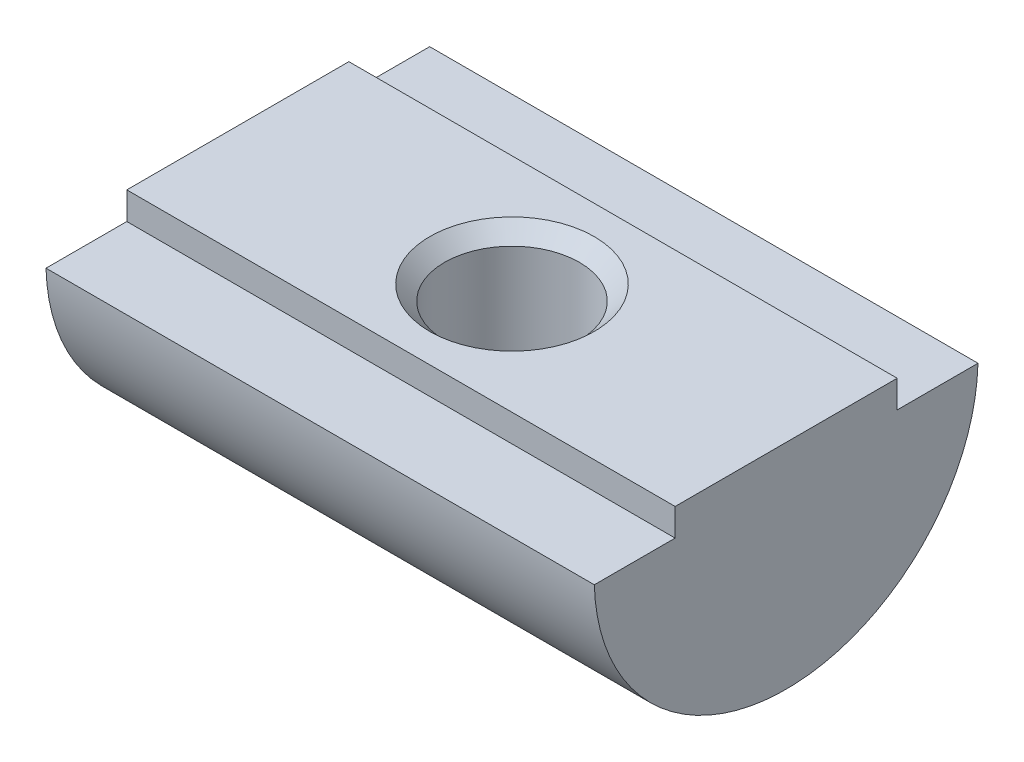
ISO-10303-21;
HEADER;
FILE_DESCRIPTION(('STEP AP214'),'2;1');
FILE_NAME('part.step','',(''),(''),'','','');
FILE_SCHEMA(('AUTOMOTIVE_DESIGN { 1 0 10303 214 1 1 1 1 }'));
ENDSEC;
DATA;
#1=APPLICATION_CONTEXT('core data for automotive mechanical design processes');
#2=APPLICATION_PROTOCOL_DEFINITION('international standard','automotive_design',2000,#1);
#3=PRODUCT_CONTEXT('',#1,'mechanical');
#4=PRODUCT('Part','Part','',(#3));
#5=PRODUCT_RELATED_PRODUCT_CATEGORY('part','',(#4));
#6=PRODUCT_DEFINITION_FORMATION('','',#4);
#7=PRODUCT_DEFINITION_CONTEXT('part definition',#1,'design');
#8=PRODUCT_DEFINITION('design','',#6,#7);
#9=PRODUCT_DEFINITION_SHAPE('','',#8);
#10=(LENGTH_UNIT() NAMED_UNIT(*) SI_UNIT(.MILLI.,.METRE.));
#11=(NAMED_UNIT(*) PLANE_ANGLE_UNIT() SI_UNIT($,.RADIAN.));
#12=(NAMED_UNIT(*) SI_UNIT($,.STERADIAN.) SOLID_ANGLE_UNIT());
#13=UNCERTAINTY_MEASURE_WITH_UNIT(LENGTH_MEASURE(1.E-05),#10,'distance_accuracy_value','');
#14=(GEOMETRIC_REPRESENTATION_CONTEXT(3) GLOBAL_UNCERTAINTY_ASSIGNED_CONTEXT((#13)) GLOBAL_UNIT_ASSIGNED_CONTEXT((#10,
#11,#12)) REPRESENTATION_CONTEXT('',''));
#15=CARTESIAN_POINT('',(0.,0.,0.));
#16=DIRECTION('',(0.,0.,1.));
#17=DIRECTION('',(1.,0.,0.));
#18=AXIS2_PLACEMENT_3D('',#15,#16,#17);
#19=CARTESIAN_POINT('',(0.,0.999999999976353,0.));
#20=DIRECTION('',(0.,1.,0.));
#21=DIRECTION('',(0.,0.,1.));
#22=AXIS2_PLACEMENT_3D('',#19,#20,#21);
#23=CONICAL_SURFACE('',#22,2.9999999999859,0.785398163397448);
#24=CARTESIAN_POINT('',(0.,0.999999999976353,0.));
#25=DIRECTION('',(0.,1.,0.));
#26=DIRECTION('',(0.,0.,1.));
#27=AXIS2_PLACEMENT_3D('',#24,#25,#26);
#28=CIRCLE('',#27,2.9999999999859);
#29=CARTESIAN_POINT('',(0.,0.999999999976353,2.9999999999859));
#30=VERTEX_POINT('',#29);
#31=EDGE_CURVE('E20',#30,#30,#28,.T.);
#32=ORIENTED_EDGE('',*,*,#31,.T.);
#33=EDGE_LOOP('',(#32));
#34=FACE_BOUND('',#33,.T.);
#35=CARTESIAN_POINT('',(0.,0.458499999999993,0.));
#36=DIRECTION('',(0.,-1.,0.));
#37=DIRECTION('',(0.,0.,-1.));
#38=AXIS2_PLACEMENT_3D('',#35,#36,#37);
#39=CIRCLE('',#38,2.4585);
#40=CARTESIAN_POINT('',(0.,0.458499999999993,-2.4585));
#41=VERTEX_POINT('',#40);
#42=EDGE_CURVE('E125',#41,#41,#39,.T.);
#43=ORIENTED_EDGE('',*,*,#42,.T.);
#44=EDGE_LOOP('',(#43));
#45=FACE_BOUND('',#44,.T.);
#46=ADVANCED_FACE('F17',(#34,#45),#23,.F.);
#47=CARTESIAN_POINT('',(10.,0.,-4.05));
#48=DIRECTION('',(0.,0.,1.));
#49=DIRECTION('',(1.,0.,0.));
#50=AXIS2_PLACEMENT_3D('',#47,#48,#49);
#51=PLANE('',#50);
#52=DIRECTION('',(1.,0.,0.));
#53=VECTOR('',#52,1.);
#54=CARTESIAN_POINT('',(10.,1.,-4.05));
#55=LINE('',#54,#53);
#56=CARTESIAN_POINT('',(-10.,1.,-4.05));
#57=VERTEX_POINT('',#56);
#58=CARTESIAN_POINT('',(10.,1.,-4.05));
#59=VERTEX_POINT('',#58);
#60=EDGE_CURVE('E83',#57,#59,#55,.T.);
#61=ORIENTED_EDGE('',*,*,#60,.T.);
#62=DIRECTION('',(0.,1.,0.));
#63=VECTOR('',#62,1.);
#64=CARTESIAN_POINT('',(10.,0.,-4.05));
#65=LINE('',#64,#63);
#66=CARTESIAN_POINT('',(10.,0.,-4.05));
#67=VERTEX_POINT('',#66);
#68=EDGE_CURVE('E77',#67,#59,#65,.T.);
#69=ORIENTED_EDGE('',*,*,#68,.F.);
#70=DIRECTION('',(1.,0.,0.));
#71=VECTOR('',#70,1.);
#72=CARTESIAN_POINT('',(10.,0.,-4.05));
#73=LINE('',#72,#71);
#74=CARTESIAN_POINT('',(-10.,0.,-4.05));
#75=VERTEX_POINT('',#74);
#76=EDGE_CURVE('E80',#67,#75,#73,.F.);
#77=ORIENTED_EDGE('',*,*,#76,.T.);
#78=DIRECTION('',(0.,1.,0.));
#79=VECTOR('',#78,1.);
#80=CARTESIAN_POINT('',(-10.,0.200000000000001,-4.05));
#81=LINE('',#80,#79);
#82=EDGE_CURVE('E128',#75,#57,#81,.T.);
#83=ORIENTED_EDGE('',*,*,#82,.T.);
#84=EDGE_LOOP('',(#61,#69,#77,#83));
#85=FACE_BOUND('',#84,.T.);
#86=ADVANCED_FACE('F79',(#85),#51,.F.);
#87=CARTESIAN_POINT('',(10.,1.,-4.05));
#88=DIRECTION('',(0.,-1.,0.));
#89=DIRECTION('',(0.,0.,-1.));
#90=AXIS2_PLACEMENT_3D('',#87,#88,#89);
#91=PLANE('',#90);
#92=ORIENTED_EDGE('',*,*,#31,.F.);
#93=EDGE_LOOP('',(#92));
#94=FACE_BOUND('',#93,.T.);
#95=DIRECTION('',(-1.,0.,0.));
#96=VECTOR('',#95,1.);
#97=CARTESIAN_POINT('',(10.,1.,4.05));
#98=LINE('',#97,#96);
#99=CARTESIAN_POINT('',(-10.,1.,4.05));
#100=VERTEX_POINT('',#99);
#101=CARTESIAN_POINT('',(10.,1.,4.05));
#102=VERTEX_POINT('',#101);
#103=EDGE_CURVE('E129',#100,#102,#98,.F.);
#104=ORIENTED_EDGE('',*,*,#103,.T.);
#105=DIRECTION('',(0.,0.,-1.));
#106=VECTOR('',#105,1.);
#107=CARTESIAN_POINT('',(10.,1.,0.));
#108=LINE('',#107,#106);
#109=EDGE_CURVE('E100',#59,#102,#108,.F.);
#110=ORIENTED_EDGE('',*,*,#109,.F.);
#111=ORIENTED_EDGE('',*,*,#60,.F.);
#112=DIRECTION('',(0.,0.,-1.));
#113=VECTOR('',#112,1.);
#114=CARTESIAN_POINT('',(-10.,1.,0.));
#115=LINE('',#114,#113);
#116=EDGE_CURVE('E133',#57,#100,#115,.F.);
#117=ORIENTED_EDGE('',*,*,#116,.T.);
#118=EDGE_LOOP('',(#104,#110,#111,#117));
#119=FACE_BOUND('',#118,.T.);
#120=ADVANCED_FACE('F196',(#94,#119),#91,.F.);
#121=CARTESIAN_POINT('',(10.,1.,4.05));
#122=DIRECTION('',(0.,0.,-1.));
#123=DIRECTION('',(-1.,0.,0.));
#124=AXIS2_PLACEMENT_3D('',#121,#122,#123);
#125=PLANE('',#124);
#126=DIRECTION('',(1.,0.,0.));
#127=VECTOR('',#126,1.);
#128=CARTESIAN_POINT('',(10.,0.,4.05));
#129=LINE('',#128,#127);
#130=CARTESIAN_POINT('',(-10.,0.,4.05));
#131=VERTEX_POINT('',#130);
#132=CARTESIAN_POINT('',(10.,0.,4.05));
#133=VERTEX_POINT('',#132);
#134=EDGE_CURVE('E56',#131,#133,#129,.T.);
#135=ORIENTED_EDGE('',*,*,#134,.T.);
#136=DIRECTION('',(0.,1.,0.));
#137=VECTOR('',#136,1.);
#138=CARTESIAN_POINT('',(10.,0.200000000000001,4.05));
#139=LINE('',#138,#137);
#140=EDGE_CURVE('E102',#102,#133,#139,.F.);
#141=ORIENTED_EDGE('',*,*,#140,.F.);
#142=ORIENTED_EDGE('',*,*,#103,.F.);
#143=DIRECTION('',(0.,1.,0.));
#144=VECTOR('',#143,1.);
#145=CARTESIAN_POINT('',(-10.,0.200000000000001,4.05));
#146=LINE('',#145,#144);
#147=EDGE_CURVE('E94',#100,#131,#146,.F.);
#148=ORIENTED_EDGE('',*,*,#147,.T.);
#149=EDGE_LOOP('',(#135,#141,#142,#148));
#150=FACE_BOUND('',#149,.T.);
#151=ADVANCED_FACE('F187',(#150),#125,.F.);
#152=CARTESIAN_POINT('',(0.,1.,0.));
#153=DIRECTION('',(0.,-1.,0.));
#154=DIRECTION('',(0.,0.,-1.));
#155=AXIS2_PLACEMENT_3D('',#152,#153,#154);
#156=CYLINDRICAL_SURFACE('',#155,2.4585);
#157=CARTESIAN_POINT('',(0.,-6.25850000005812,0.));
#158=DIRECTION('',(0.,-1.,0.));
#159=DIRECTION('',(0.,0.,-1.));
#160=AXIS2_PLACEMENT_3D('',#157,#158,#159);
#161=CIRCLE('',#160,2.45849999993197);
#162=CARTESIAN_POINT('',(0.,-6.25850000005812,-2.45849999993197));
#163=VERTEX_POINT('',#162);
#164=EDGE_CURVE('E122',#163,#163,#161,.T.);
#165=ORIENTED_EDGE('',*,*,#164,.T.);
#166=EDGE_LOOP('',(#165));
#167=FACE_BOUND('',#166,.T.);
#168=ORIENTED_EDGE('',*,*,#42,.F.);
#169=EDGE_LOOP('',(#168));
#170=FACE_BOUND('',#169,.T.);
#171=ADVANCED_FACE('F182',(#167,#170),#156,.F.);
#172=CARTESIAN_POINT('',(-10.,0.200000000000001,0.));
#173=DIRECTION('',(1.,0.,0.));
#174=DIRECTION('',(0.,0.,-1.));
#175=AXIS2_PLACEMENT_3D('',#172,#173,#174);
#176=PLANE('',#175);
#177=DIRECTION('',(0.,0.,-1.));
#178=VECTOR('',#177,1.);
#179=CARTESIAN_POINT('',(-10.,0.,4.05));
#180=LINE('',#179,#178);
#181=CARTESIAN_POINT('',(-10.,0.,6.99714227381436));
#182=VERTEX_POINT('',#181);
#183=EDGE_CURVE('E116',#182,#131,#180,.T.);
#184=ORIENTED_EDGE('',*,*,#183,.T.);
#185=ORIENTED_EDGE('',*,*,#147,.F.);
#186=ORIENTED_EDGE('',*,*,#116,.F.);
#187=ORIENTED_EDGE('',*,*,#82,.F.);
#188=DIRECTION('',(0.,0.,-1.));
#189=VECTOR('',#188,1.);
#190=CARTESIAN_POINT('',(-10.,0.,-6.99714227381436));
#191=LINE('',#190,#189);
#192=CARTESIAN_POINT('',(-10.,0.,-6.99714227381436));
#193=VERTEX_POINT('',#192);
#194=EDGE_CURVE('E93',#75,#193,#191,.T.);
#195=ORIENTED_EDGE('',*,*,#194,.T.);
#196=CARTESIAN_POINT('',(-10.,0.200000000000001,0.));
#197=DIRECTION('',(-1.,0.,0.));
#198=DIRECTION('',(0.,0.,1.));
#199=AXIS2_PLACEMENT_3D('',#196,#197,#198);
#200=CIRCLE('',#199,7.);
#201=EDGE_CURVE('E47',#182,#193,#200,.F.);
#202=ORIENTED_EDGE('',*,*,#201,.F.);
#203=EDGE_LOOP('',(#184,#185,#186,#187,#195,#202));
#204=FACE_BOUND('',#203,.T.);
#205=ADVANCED_FACE('F186',(#204),#176,.F.);
#206=CARTESIAN_POINT('',(10.,0.,-6.99714227381436));
#207=DIRECTION('',(0.,-1.,0.));
#208=DIRECTION('',(0.,0.,-1.));
#209=AXIS2_PLACEMENT_3D('',#206,#207,#208);
#210=PLANE('',#209);
#211=ORIENTED_EDGE('',*,*,#76,.F.);
#212=DIRECTION('',(0.,0.,-1.));
#213=VECTOR('',#212,1.);
#214=CARTESIAN_POINT('',(10.,0.,0.));
#215=LINE('',#214,#213);
#216=CARTESIAN_POINT('',(10.,0.,-6.99714227381436));
#217=VERTEX_POINT('',#216);
#218=EDGE_CURVE('E92',#217,#67,#215,.F.);
#219=ORIENTED_EDGE('',*,*,#218,.F.);
#220=DIRECTION('',(-1.,0.,0.));
#221=VECTOR('',#220,1.);
#222=CARTESIAN_POINT('',(10.,0.,-6.99714227381436));
#223=LINE('',#222,#221);
#224=EDGE_CURVE('E111',#193,#217,#223,.F.);
#225=ORIENTED_EDGE('',*,*,#224,.F.);
#226=ORIENTED_EDGE('',*,*,#194,.F.);
#227=EDGE_LOOP('',(#211,#219,#225,#226));
#228=FACE_BOUND('',#227,.T.);
#229=ADVANCED_FACE('F90',(#228),#210,.F.);
#230=CARTESIAN_POINT('',(10.,0.200000000000001,0.));
#231=DIRECTION('',(1.,0.,0.));
#232=DIRECTION('',(0.,0.,-1.));
#233=AXIS2_PLACEMENT_3D('',#230,#231,#232);
#234=PLANE('',#233);
#235=ORIENTED_EDGE('',*,*,#140,.T.);
#236=DIRECTION('',(0.,0.,-1.));
#237=VECTOR('',#236,1.);
#238=CARTESIAN_POINT('',(10.,0.,4.05));
#239=LINE('',#238,#237);
#240=CARTESIAN_POINT('',(10.,0.,6.99714227381436));
#241=VERTEX_POINT('',#240);
#242=EDGE_CURVE('E35',#133,#241,#239,.F.);
#243=ORIENTED_EDGE('',*,*,#242,.T.);
#244=CARTESIAN_POINT('',(10.,0.200000000000001,0.));
#245=DIRECTION('',(-1.,0.,0.));
#246=DIRECTION('',(0.,0.,1.));
#247=AXIS2_PLACEMENT_3D('',#244,#245,#246);
#248=CIRCLE('',#247,7.);
#249=EDGE_CURVE('E98',#217,#241,#248,.T.);
#250=ORIENTED_EDGE('',*,*,#249,.F.);
#251=ORIENTED_EDGE('',*,*,#218,.T.);
#252=ORIENTED_EDGE('',*,*,#68,.T.);
#253=ORIENTED_EDGE('',*,*,#109,.T.);
#254=EDGE_LOOP('',(#235,#243,#250,#251,#252,#253));
#255=FACE_BOUND('',#254,.T.);
#256=ADVANCED_FACE('F96',(#255),#234,.T.);
#257=CARTESIAN_POINT('',(10.,0.,4.05));
#258=DIRECTION('',(0.,-1.,0.));
#259=DIRECTION('',(0.,0.,-1.));
#260=AXIS2_PLACEMENT_3D('',#257,#258,#259);
#261=PLANE('',#260);
#262=DIRECTION('',(-1.,0.,0.));
#263=VECTOR('',#262,1.);
#264=CARTESIAN_POINT('',(10.,0.,6.99714227381436));
#265=LINE('',#264,#263);
#266=EDGE_CURVE('E26',#241,#182,#265,.T.);
#267=ORIENTED_EDGE('',*,*,#266,.F.);
#268=ORIENTED_EDGE('',*,*,#242,.F.);
#269=ORIENTED_EDGE('',*,*,#134,.F.);
#270=ORIENTED_EDGE('',*,*,#183,.F.);
#271=EDGE_LOOP('',(#267,#268,#269,#270));
#272=FACE_BOUND('',#271,.T.);
#273=ADVANCED_FACE('F175',(#272),#261,.F.);
#274=CARTESIAN_POINT('',(0.,-6.80332464787625,0.));
#275=DIRECTION('',(0.,-1.,0.));
#276=DIRECTION('',(0.,0.,-1.));
#277=AXIS2_PLACEMENT_3D('',#274,#275,#276);
#278=CONICAL_SURFACE('',#277,3.00332464775011,0.785398163397448);
#279=CARTESIAN_POINT('',(0.,-6.3276925690884,-2.52769256898105));
#280=CARTESIAN_POINT('',(-0.183875042928642,-6.32770082941167,-2.52768699805773));
#281=CARTESIAN_POINT('',(-0.367845647121173,-6.33336261232259,-2.51319782214442));
#282=CARTESIAN_POINT('',(-0.730739180788536,-6.35528108112437,-2.45544446498763));
#283=CARTESIAN_POINT('',(-0.909655795355433,-6.37155045882868,-2.41214581240299));
#284=CARTESIAN_POINT('',(-1.25732267176799,-6.41256070185786,-2.29733535766257));
#285=CARTESIAN_POINT('',(-1.4260658418828,-6.43730739808181,-2.22580413131193));
#286=CARTESIAN_POINT('',(-1.74809299576108,-6.49208926995522,-2.05522197715682));
#287=CARTESIAN_POINT('',(-1.90138665244656,-6.52212110382827,-1.95618841625745));
#288=CARTESIAN_POINT('',(-2.16025875110304,-6.57778280881526,-1.75232461794637));
#289=CARTESIAN_POINT('',(-2.26941502567967,-6.60319697205487,-1.65197029317303));
#290=CARTESIAN_POINT('',(-2.46978318301668,-6.65237136029756,-1.43436307112869));
#291=CARTESIAN_POINT('',(-2.56101836143281,-6.67613370617334,-1.31713245971191));
#292=CARTESIAN_POINT('',(-2.70777567215198,-6.71570078671798,-1.08822539025947));
#293=CARTESIAN_POINT('',(-2.76671236789136,-6.73217169305242,-0.978859039299437));
#294=CARTESIAN_POINT('',(-2.86617928907274,-6.76048893076501,-0.75145331286502));
#295=CARTESIAN_POINT('',(-2.90672036899665,-6.77233798872124,-0.633419099832457));
#296=CARTESIAN_POINT('',(-2.96708763368817,-6.79013209326777,-0.390997501386833));
#297=CARTESIAN_POINT('',(-2.98680296119227,-6.79604553585583,-0.266579776748751));
#298=CARTESIAN_POINT('',(-3.00367769612878,-6.80110051980282,-0.0160901967009481));
#299=CARTESIAN_POINT('',(-3.00084442771188,-6.80024426007176,0.109981108316434));
#300=CARTESIAN_POINT('',(-2.97414377006762,-6.79226490426933,0.348064850664954));
#301=CARTESIAN_POINT('',(-2.95219646000242,-6.78571396885392,0.460319777481792));
#302=CARTESIAN_POINT('',(-2.89116052363825,-6.76779849771431,0.679631910070351));
#303=CARTESIAN_POINT('',(-2.85206920509298,-6.75643320596685,0.786688296544057));
#304=CARTESIAN_POINT('',(-2.75678121574292,-6.72939505416925,0.997630361632043));
#305=CARTESIAN_POINT('',(-2.69994906393542,-6.71356471945751,1.10120618768842));
#306=CARTESIAN_POINT('',(-2.57225360268992,-6.67919079072546,1.29877203168461));
#307=CARTESIAN_POINT('',(-2.50138424621341,-6.66064602826811,1.39275789186571));
#308=CARTESIAN_POINT('',(-2.33577796864177,-6.61917870619764,1.58425448136722));
#309=CARTESIAN_POINT('',(-2.23903946735093,-6.59602709563269,1.67998136910698));
#310=CARTESIAN_POINT('',(-2.03288673842924,-6.54989751898719,1.85667331482522));
#311=CARTESIAN_POINT('',(-1.92346400203276,-6.52691968061166,1.93762836883827));
#312=CARTESIAN_POINT('',(-1.67366417196022,-6.4789014551803,2.09773530517361));
#313=CARTESIAN_POINT('',(-1.5312777647561,-6.45424670332447,2.17387794563575));
#314=CARTESIAN_POINT('',(-1.23611607981285,-6.41016014987195,2.30446000967173));
#315=CARTESIAN_POINT('',(-1.08333578199974,-6.39073089486543,2.35888885748255));
#316=CARTESIAN_POINT('',(-0.75370459445273,-6.35734125429752,2.45029324805457));
#317=CARTESIAN_POINT('',(-0.576050477542983,-6.34421332208957,2.48470307337978));
#318=CARTESIAN_POINT('',(-0.217117336767713,-6.32852372866342,2.52564082718632));
#319=CARTESIAN_POINT('',(-0.0358382726575947,-6.32596218482004,2.53216844594321));
#320=CARTESIAN_POINT('',(0.328606367240124,-6.33178872952853,2.51710291164531));
#321=CARTESIAN_POINT('',(0.511748383601869,-6.3403718129804,2.49500899002381));
#322=CARTESIAN_POINT('',(0.8715571659619,-6.36768874428197,2.42218008919936));
#323=CARTESIAN_POINT('',(1.04822057394879,-6.38642777896517,2.37143047444539));
#324=CARTESIAN_POINT('',(1.39013650249342,-6.43164102894239,2.24188253988551));
#325=CARTESIAN_POINT('',(1.55537581598801,-6.45812401784144,2.16305238367036));
#326=CARTESIAN_POINT('',(1.86897340254195,-6.5154070026506,1.97804265315564));
#327=CARTESIAN_POINT('',(2.01734380829866,-6.54620385983624,1.87188291692858));
#328=CARTESIAN_POINT('',(2.26228381781266,-6.60142649202982,1.65832852774478));
#329=CARTESIAN_POINT('',(2.36318577834834,-6.62583038597398,1.55588648181704));
#330=CARTESIAN_POINT('',(2.54693398452102,-6.67234666114212,1.33547058986711));
#331=CARTESIAN_POINT('',(2.62980459149486,-6.69446211270898,1.21751804962807));
#332=CARTESIAN_POINT('',(2.76202583548335,-6.73080461705758,0.987565534620174));
#333=CARTESIAN_POINT('',(2.81459463291753,-6.74572479772118,0.877530995232338));
#334=CARTESIAN_POINT('',(2.90127995410521,-6.77070657433397,0.649864798572439));
#335=CARTESIAN_POINT('',(2.93540697168623,-6.78077093301546,0.532237504515312));
#336=CARTESIAN_POINT('',(2.98320169112746,-6.79494779763766,0.291950628394113));
#337=CARTESIAN_POINT('',(2.99677847961462,-6.7990338531671,0.169271136932888));
#338=CARTESIAN_POINT('',(3.00219923946648,-6.80065948409175,-0.0766079474771212));
#339=CARTESIAN_POINT('',(2.99404671811888,-6.79820011597178,-0.199807453286639));
#340=CARTESIAN_POINT('',(2.95803101832586,-6.78747024011741,-0.433518163940912));
#341=CARTESIAN_POINT('',(2.93168446285996,-6.77964717753286,-0.544290062943397));
#342=CARTESIAN_POINT('',(2.86242243868644,-6.7594592911821,-0.760053013065582));
#343=CARTESIAN_POINT('',(2.81950373531962,-6.74709358077539,-0.865042931046666));
#344=CARTESIAN_POINT('',(2.71611001424912,-6.71807273966963,-1.07330733012901));
#345=CARTESIAN_POINT('',(2.65473859318396,-6.70120531857211,-1.17610376299683));
#346=CARTESIAN_POINT('',(2.51817767853513,-6.66503916844399,-1.37154470999261));
#347=CARTESIAN_POINT('',(2.44298200633129,-6.64573935349536,-1.46418465510096));
#348=CARTESIAN_POINT('',(2.26763253460217,-6.60282879251741,-1.65299518040059));
#349=CARTESIAN_POINT('',(2.16540777818952,-6.57903432635423,-1.74719816742128));
#350=CARTESIAN_POINT('',(1.94843420393087,-6.53210902889361,-1.92009037657919));
#351=CARTESIAN_POINT('',(1.8336751124285,-6.50897876190917,-1.99876672194215));
#352=CARTESIAN_POINT('',(1.57293614832251,-6.46130903658274,-2.15280934792353));
#353=CARTESIAN_POINT('',(1.42503715029546,-6.43725311949436,-2.22508669166626));
#354=CARTESIAN_POINT('',(1.11945208333268,-6.39514704155183,-2.34695727077979));
#355=CARTESIAN_POINT('',(0.961769179328522,-6.37709495045372,-2.39655779872451));
#356=CARTESIAN_POINT('',(0.670248354089416,-6.35150326465236,-2.46553784963167));
#357=CARTESIAN_POINT('',(0.53743689785811,-6.34263217519255,-2.48882467137287));
#358=CARTESIAN_POINT('',(0.269767420908022,-6.33072384188021,-2.51990395582233));
#359=CARTESIAN_POINT('',(0.134909431637078,-6.32768650847517,-2.52769665637695));
#360=CARTESIAN_POINT('',(0.,-6.3276925690884,-2.52769256898105));
#361=B_SPLINE_CURVE_WITH_KNOTS('',3,(#279,#280,#281,#282,#283,#284,#285,#286,#287,#288,#289,
#290,#291,#292,#293,#294,#295,#296,#297,#298,#299,#300,#301,#302,#303,#304,#305,#306,#307,#308,
#309,#310,#311,#312,#313,#314,#315,#316,#317,#318,#319,#320,#321,#322,#323,#324,#325,#326,#327,
#328,#329,#330,#331,#332,#333,#334,#335,#336,#337,#338,#339,#340,#341,#342,#343,#344,#345,#346,
#347,#348,#349,#350,#351,#352,#353,#354,#355,#356,#357,#358,#359,#360),.UNSPECIFIED.,.T.,.F.,(4,
2,2,2,2,2,2,2,2,2,2,2,2,2,2,2,2,2,2,2,2,2,2,2,2,2,2,2,2,2,2,2,2,2,2,2,2,2,2,2,4),(0.,
0.551143052905681,1.10294675258009,1.65513076043844,2.20696687032361,2.65653004917855,
3.10550491571873,3.4799272205713,3.85412830629619,4.23031141047219,4.60637232924605,
4.94851691886872,5.29071525715341,5.64694062705282,6.00331978910759,6.41593202494503,
6.82882266638708,7.31685292661339,7.80512059398366,8.34688623152393,8.88865788715415,
9.44003773975563,9.99169945804784,10.5439886258286,11.0958780212576,11.5317306500899,
11.9669907107145,12.3340189905631,12.7008382017632,13.0692755112492,13.4376533555523,
13.7785354638136,14.1194841413144,14.4808219549244,14.8423216594571,15.2638421609838,
15.685710788195,16.1827657849671,16.6796608225788,17.0840416251933,17.4884162202115),.UNSPECIFIED.);
#362=CARTESIAN_POINT('',(0.,-6.3276925690884,-2.52769256898105));
#363=VERTEX_POINT('',#362);
#364=EDGE_CURVE('E11',#363,#363,#361,.T.);
#365=ORIENTED_EDGE('',*,*,#364,.F.);
#366=EDGE_LOOP('',(#365));
#367=FACE_BOUND('',#366,.T.);
#368=ORIENTED_EDGE('',*,*,#164,.F.);
#369=EDGE_LOOP('',(#368));
#370=FACE_BOUND('',#369,.T.);
#371=ADVANCED_FACE('F164',(#367,#370),#278,.F.);
#372=CARTESIAN_POINT('',(10.,0.200000000000001,0.));
#373=DIRECTION('',(-1.,0.,0.));
#374=DIRECTION('',(0.,0.,1.));
#375=AXIS2_PLACEMENT_3D('',#372,#373,#374);
#376=CYLINDRICAL_SURFACE('',#375,7.);
#377=ORIENTED_EDGE('',*,*,#364,.T.);
#378=EDGE_LOOP('',(#377));
#379=FACE_BOUND('',#378,.T.);
#380=ORIENTED_EDGE('',*,*,#249,.T.);
#381=ORIENTED_EDGE('',*,*,#266,.T.);
#382=ORIENTED_EDGE('',*,*,#201,.T.);
#383=ORIENTED_EDGE('',*,*,#224,.T.);
#384=EDGE_LOOP('',(#380,#381,#382,#383));
#385=FACE_BOUND('',#384,.T.);
#386=ADVANCED_FACE('F167',(#379,#385),#376,.T.);
#387=CLOSED_SHELL('',(#46,#86,#120,#151,#171,#205,#229,#256,#273,#371,#386));
#388=MANIFOLD_SOLID_BREP('B1',#387);
#389=ADVANCED_BREP_SHAPE_REPRESENTATION('',(#18,#388),#14);
#390=SHAPE_DEFINITION_REPRESENTATION(#9,#389);
ENDSEC;
END-ISO-10303-21;
